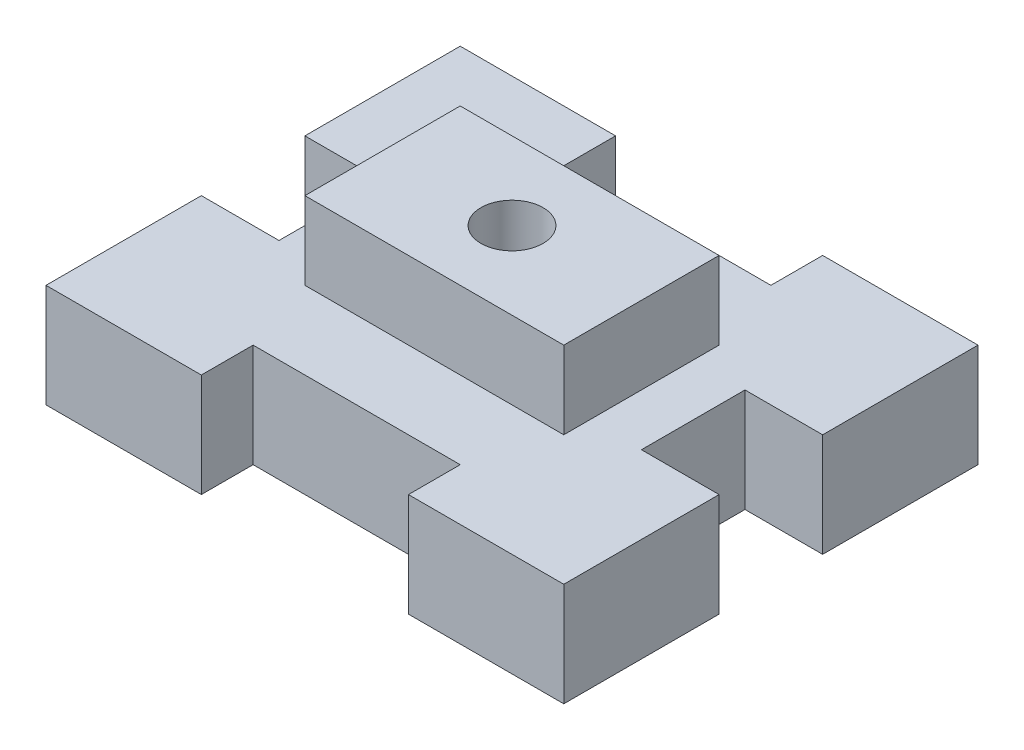
ISO-10303-21;
HEADER;
FILE_DESCRIPTION(('STEP AP214'),'2;1');
FILE_NAME('part.step','',(''),(''),'','','');
FILE_SCHEMA(('AUTOMOTIVE_DESIGN { 1 0 10303 214 1 1 1 1 }'));
ENDSEC;
DATA;
#1=APPLICATION_CONTEXT('core data for automotive mechanical design processes');
#2=APPLICATION_PROTOCOL_DEFINITION('international standard','automotive_design',2000,#1);
#3=PRODUCT_CONTEXT('',#1,'mechanical');
#4=PRODUCT('Part','Part','',(#3));
#5=PRODUCT_RELATED_PRODUCT_CATEGORY('part','',(#4));
#6=PRODUCT_DEFINITION_FORMATION('','',#4);
#7=PRODUCT_DEFINITION_CONTEXT('part definition',#1,'design');
#8=PRODUCT_DEFINITION('design','',#6,#7);
#9=PRODUCT_DEFINITION_SHAPE('','',#8);
#10=(LENGTH_UNIT() NAMED_UNIT(*) SI_UNIT(.MILLI.,.METRE.));
#11=(NAMED_UNIT(*) PLANE_ANGLE_UNIT() SI_UNIT($,.RADIAN.));
#12=(NAMED_UNIT(*) SI_UNIT($,.STERADIAN.) SOLID_ANGLE_UNIT());
#13=UNCERTAINTY_MEASURE_WITH_UNIT(LENGTH_MEASURE(1.E-05),#10,'distance_accuracy_value','');
#14=(GEOMETRIC_REPRESENTATION_CONTEXT(3) GLOBAL_UNCERTAINTY_ASSIGNED_CONTEXT((#13)) GLOBAL_UNIT_ASSIGNED_CONTEXT((#10,
#11,#12)) REPRESENTATION_CONTEXT('',''));
#15=CARTESIAN_POINT('',(0.,0.,0.));
#16=DIRECTION('',(0.,0.,1.));
#17=DIRECTION('',(1.,0.,0.));
#18=AXIS2_PLACEMENT_3D('',#15,#16,#17);
#19=CARTESIAN_POINT('',(0.,-10.,30.));
#20=DIRECTION('',(-1.,0.,0.));
#21=DIRECTION('',(0.,0.,1.));
#22=AXIS2_PLACEMENT_3D('',#19,#20,#21);
#23=PLANE('',#22);
#24=DIRECTION('',(0.,1.,0.));
#25=VECTOR('',#24,1.);
#26=CARTESIAN_POINT('',(0.,-10.,30.));
#27=LINE('',#26,#25);
#28=CARTESIAN_POINT('',(0.,-10.,30.));
#29=VERTEX_POINT('',#28);
#30=CARTESIAN_POINT('',(0.,10.,30.));
#31=VERTEX_POINT('',#30);
#32=EDGE_CURVE('E464',#29,#31,#27,.T.);
#33=ORIENTED_EDGE('',*,*,#32,.T.);
#34=DIRECTION('',(0.,0.,1.));
#35=VECTOR('',#34,1.);
#36=CARTESIAN_POINT('',(0.,10.,30.));
#37=LINE('',#36,#35);
#38=CARTESIAN_POINT('',(0.,10.,0.));
#39=VERTEX_POINT('',#38);
#40=EDGE_CURVE('E304',#39,#31,#37,.T.);
#41=ORIENTED_EDGE('',*,*,#40,.F.);
#42=DIRECTION('',(0.,1.,0.));
#43=VECTOR('',#42,1.);
#44=CARTESIAN_POINT('',(0.,-10.,0.));
#45=LINE('',#44,#43);
#46=CARTESIAN_POINT('',(0.,-10.,0.));
#47=VERTEX_POINT('',#46);
#48=EDGE_CURVE('E465',#47,#39,#45,.T.);
#49=ORIENTED_EDGE('',*,*,#48,.F.);
#50=DIRECTION('',(0.,0.,1.));
#51=VECTOR('',#50,1.);
#52=CARTESIAN_POINT('',(0.,-10.,30.));
#53=LINE('',#52,#51);
#54=EDGE_CURVE('E384',#47,#29,#53,.T.);
#55=ORIENTED_EDGE('',*,*,#54,.T.);
#56=EDGE_LOOP('',(#33,#41,#49,#55));
#57=FACE_BOUND('',#56,.T.);
#58=ADVANCED_FACE('F39',(#57),#23,.T.);
#59=CARTESIAN_POINT('',(0.,-10.,0.));
#60=DIRECTION('',(0.,0.,-1.));
#61=DIRECTION('',(-1.,0.,0.));
#62=AXIS2_PLACEMENT_3D('',#59,#60,#61);
#63=PLANE('',#62);
#64=ORIENTED_EDGE('',*,*,#48,.T.);
#65=DIRECTION('',(-1.,0.,0.));
#66=VECTOR('',#65,1.);
#67=CARTESIAN_POINT('',(0.,10.,0.));
#68=LINE('',#67,#66);
#69=CARTESIAN_POINT('',(30.,10.,0.));
#70=VERTEX_POINT('',#69);
#71=EDGE_CURVE('E380',#70,#39,#68,.T.);
#72=ORIENTED_EDGE('',*,*,#71,.F.);
#73=DIRECTION('',(0.,1.,0.));
#74=VECTOR('',#73,1.);
#75=CARTESIAN_POINT('',(30.,-10.,0.));
#76=LINE('',#75,#74);
#77=CARTESIAN_POINT('',(30.,-10.,0.));
#78=VERTEX_POINT('',#77);
#79=EDGE_CURVE('E469',#78,#70,#76,.T.);
#80=ORIENTED_EDGE('',*,*,#79,.F.);
#81=DIRECTION('',(-1.,0.,0.));
#82=VECTOR('',#81,1.);
#83=CARTESIAN_POINT('',(0.,-10.,0.));
#84=LINE('',#83,#82);
#85=EDGE_CURVE('E460',#78,#47,#84,.T.);
#86=ORIENTED_EDGE('',*,*,#85,.T.);
#87=EDGE_LOOP('',(#64,#72,#80,#86));
#88=FACE_BOUND('',#87,.T.);
#89=ADVANCED_FACE('F557',(#88),#63,.T.);
#90=CARTESIAN_POINT('',(30.,-10.,0.));
#91=DIRECTION('',(1.,0.,0.));
#92=DIRECTION('',(0.,0.,-1.));
#93=AXIS2_PLACEMENT_3D('',#90,#91,#92);
#94=PLANE('',#93);
#95=ORIENTED_EDGE('',*,*,#79,.T.);
#96=DIRECTION('',(0.,0.,-1.));
#97=VECTOR('',#96,1.);
#98=CARTESIAN_POINT('',(30.,10.,0.));
#99=LINE('',#98,#97);
#100=CARTESIAN_POINT('',(30.,10.,10.));
#101=VERTEX_POINT('',#100);
#102=EDGE_CURVE('E376',#101,#70,#99,.T.);
#103=ORIENTED_EDGE('',*,*,#102,.F.);
#104=DIRECTION('',(0.,1.,0.));
#105=VECTOR('',#104,1.);
#106=CARTESIAN_POINT('',(30.,-10.,10.));
#107=LINE('',#106,#105);
#108=CARTESIAN_POINT('',(30.,-10.,10.));
#109=VERTEX_POINT('',#108);
#110=EDGE_CURVE('E472',#109,#101,#107,.T.);
#111=ORIENTED_EDGE('',*,*,#110,.F.);
#112=DIRECTION('',(0.,0.,-1.));
#113=VECTOR('',#112,1.);
#114=CARTESIAN_POINT('',(30.,-10.,0.));
#115=LINE('',#114,#113);
#116=EDGE_CURVE('E456',#109,#78,#115,.T.);
#117=ORIENTED_EDGE('',*,*,#116,.T.);
#118=EDGE_LOOP('',(#95,#103,#111,#117));
#119=FACE_BOUND('',#118,.T.);
#120=ADVANCED_FACE('F562',(#119),#94,.T.);
#121=CARTESIAN_POINT('',(30.,-10.,10.));
#122=DIRECTION('',(0.,0.,-1.));
#123=DIRECTION('',(-1.,0.,0.));
#124=AXIS2_PLACEMENT_3D('',#121,#122,#123);
#125=PLANE('',#124);
#126=ORIENTED_EDGE('',*,*,#110,.T.);
#127=DIRECTION('',(-1.,0.,0.));
#128=VECTOR('',#127,1.);
#129=CARTESIAN_POINT('',(30.,10.,10.));
#130=LINE('',#129,#128);
#131=CARTESIAN_POINT('',(70.,10.,10.));
#132=VERTEX_POINT('',#131);
#133=EDGE_CURVE('E372',#132,#101,#130,.T.);
#134=ORIENTED_EDGE('',*,*,#133,.F.);
#135=DIRECTION('',(0.,1.,0.));
#136=VECTOR('',#135,1.);
#137=CARTESIAN_POINT('',(70.,-10.,10.));
#138=LINE('',#137,#136);
#139=CARTESIAN_POINT('',(70.,-10.,10.));
#140=VERTEX_POINT('',#139);
#141=EDGE_CURVE('E475',#140,#132,#138,.T.);
#142=ORIENTED_EDGE('',*,*,#141,.F.);
#143=DIRECTION('',(-1.,0.,0.));
#144=VECTOR('',#143,1.);
#145=CARTESIAN_POINT('',(30.,-10.,10.));
#146=LINE('',#145,#144);
#147=EDGE_CURVE('E452',#140,#109,#146,.T.);
#148=ORIENTED_EDGE('',*,*,#147,.T.);
#149=EDGE_LOOP('',(#126,#134,#142,#148));
#150=FACE_BOUND('',#149,.T.);
#151=ADVANCED_FACE('F639',(#150),#125,.T.);
#152=CARTESIAN_POINT('',(70.,-10.,10.));
#153=DIRECTION('',(-1.,0.,0.));
#154=DIRECTION('',(0.,0.,1.));
#155=AXIS2_PLACEMENT_3D('',#152,#153,#154);
#156=PLANE('',#155);
#157=ORIENTED_EDGE('',*,*,#141,.T.);
#158=DIRECTION('',(0.,0.,1.));
#159=VECTOR('',#158,1.);
#160=CARTESIAN_POINT('',(70.,10.,10.));
#161=LINE('',#160,#159);
#162=CARTESIAN_POINT('',(70.,10.,0.));
#163=VERTEX_POINT('',#162);
#164=EDGE_CURVE('E368',#163,#132,#161,.T.);
#165=ORIENTED_EDGE('',*,*,#164,.F.);
#166=DIRECTION('',(0.,1.,0.));
#167=VECTOR('',#166,1.);
#168=CARTESIAN_POINT('',(70.,-10.,0.));
#169=LINE('',#168,#167);
#170=CARTESIAN_POINT('',(70.,-10.,0.));
#171=VERTEX_POINT('',#170);
#172=EDGE_CURVE('E478',#171,#163,#169,.T.);
#173=ORIENTED_EDGE('',*,*,#172,.F.);
#174=DIRECTION('',(0.,0.,1.));
#175=VECTOR('',#174,1.);
#176=CARTESIAN_POINT('',(70.,-10.,10.));
#177=LINE('',#176,#175);
#178=EDGE_CURVE('E448',#171,#140,#177,.T.);
#179=ORIENTED_EDGE('',*,*,#178,.T.);
#180=EDGE_LOOP('',(#157,#165,#173,#179));
#181=FACE_BOUND('',#180,.T.);
#182=ADVANCED_FACE('F636',(#181),#156,.T.);
#183=CARTESIAN_POINT('',(70.,-10.,0.));
#184=DIRECTION('',(0.,0.,-1.));
#185=DIRECTION('',(-1.,0.,0.));
#186=AXIS2_PLACEMENT_3D('',#183,#184,#185);
#187=PLANE('',#186);
#188=ORIENTED_EDGE('',*,*,#172,.T.);
#189=DIRECTION('',(-1.,0.,0.));
#190=VECTOR('',#189,1.);
#191=CARTESIAN_POINT('',(70.,10.,0.));
#192=LINE('',#191,#190);
#193=CARTESIAN_POINT('',(100.,10.,0.));
#194=VERTEX_POINT('',#193);
#195=EDGE_CURVE('E364',#194,#163,#192,.T.);
#196=ORIENTED_EDGE('',*,*,#195,.F.);
#197=DIRECTION('',(0.,1.,0.));
#198=VECTOR('',#197,1.);
#199=CARTESIAN_POINT('',(100.,-10.,0.));
#200=LINE('',#199,#198);
#201=CARTESIAN_POINT('',(100.,-10.,0.));
#202=VERTEX_POINT('',#201);
#203=EDGE_CURVE('E481',#202,#194,#200,.T.);
#204=ORIENTED_EDGE('',*,*,#203,.F.);
#205=DIRECTION('',(-1.,0.,0.));
#206=VECTOR('',#205,1.);
#207=CARTESIAN_POINT('',(70.,-10.,0.));
#208=LINE('',#207,#206);
#209=EDGE_CURVE('E444',#202,#171,#208,.T.);
#210=ORIENTED_EDGE('',*,*,#209,.T.);
#211=EDGE_LOOP('',(#188,#196,#204,#210));
#212=FACE_BOUND('',#211,.T.);
#213=ADVANCED_FACE('F634',(#212),#187,.T.);
#214=CARTESIAN_POINT('',(100.,-10.,0.));
#215=DIRECTION('',(1.,0.,0.));
#216=DIRECTION('',(0.,0.,-1.));
#217=AXIS2_PLACEMENT_3D('',#214,#215,#216);
#218=PLANE('',#217);
#219=ORIENTED_EDGE('',*,*,#203,.T.);
#220=DIRECTION('',(0.,0.,-1.));
#221=VECTOR('',#220,1.);
#222=CARTESIAN_POINT('',(100.,10.,0.));
#223=LINE('',#222,#221);
#224=CARTESIAN_POINT('',(100.,10.,30.));
#225=VERTEX_POINT('',#224);
#226=EDGE_CURVE('E360',#225,#194,#223,.T.);
#227=ORIENTED_EDGE('',*,*,#226,.F.);
#228=DIRECTION('',(0.,1.,0.));
#229=VECTOR('',#228,1.);
#230=CARTESIAN_POINT('',(100.,-10.,30.));
#231=LINE('',#230,#229);
#232=CARTESIAN_POINT('',(100.,-10.,30.));
#233=VERTEX_POINT('',#232);
#234=EDGE_CURVE('E484',#233,#225,#231,.T.);
#235=ORIENTED_EDGE('',*,*,#234,.F.);
#236=DIRECTION('',(0.,0.,-1.));
#237=VECTOR('',#236,1.);
#238=CARTESIAN_POINT('',(100.,-10.,0.));
#239=LINE('',#238,#237);
#240=EDGE_CURVE('E440',#233,#202,#239,.T.);
#241=ORIENTED_EDGE('',*,*,#240,.T.);
#242=EDGE_LOOP('',(#219,#227,#235,#241));
#243=FACE_BOUND('',#242,.T.);
#244=ADVANCED_FACE('F629',(#243),#218,.T.);
#245=CARTESIAN_POINT('',(100.,-10.,30.));
#246=DIRECTION('',(0.,0.,1.));
#247=DIRECTION('',(1.,0.,0.));
#248=AXIS2_PLACEMENT_3D('',#245,#246,#247);
#249=PLANE('',#248);
#250=ORIENTED_EDGE('',*,*,#234,.T.);
#251=DIRECTION('',(1.,0.,0.));
#252=VECTOR('',#251,1.);
#253=CARTESIAN_POINT('',(100.,10.,30.));
#254=LINE('',#253,#252);
#255=CARTESIAN_POINT('',(85.,10.,30.));
#256=VERTEX_POINT('',#255);
#257=EDGE_CURVE('E356',#256,#225,#254,.T.);
#258=ORIENTED_EDGE('',*,*,#257,.F.);
#259=DIRECTION('',(0.,1.,0.));
#260=VECTOR('',#259,1.);
#261=CARTESIAN_POINT('',(85.,-10.,30.));
#262=LINE('',#261,#260);
#263=CARTESIAN_POINT('',(85.,-10.,30.));
#264=VERTEX_POINT('',#263);
#265=EDGE_CURVE('E487',#264,#256,#262,.T.);
#266=ORIENTED_EDGE('',*,*,#265,.F.);
#267=DIRECTION('',(1.,0.,0.));
#268=VECTOR('',#267,1.);
#269=CARTESIAN_POINT('',(100.,-10.,30.));
#270=LINE('',#269,#268);
#271=EDGE_CURVE('E436',#264,#233,#270,.T.);
#272=ORIENTED_EDGE('',*,*,#271,.T.);
#273=EDGE_LOOP('',(#250,#258,#266,#272));
#274=FACE_BOUND('',#273,.T.);
#275=ADVANCED_FACE('F624',(#274),#249,.T.);
#276=CARTESIAN_POINT('',(85.,-10.,30.));
#277=DIRECTION('',(1.,0.,0.));
#278=DIRECTION('',(0.,0.,-1.));
#279=AXIS2_PLACEMENT_3D('',#276,#277,#278);
#280=PLANE('',#279);
#281=ORIENTED_EDGE('',*,*,#265,.T.);
#282=DIRECTION('',(0.,0.,-1.));
#283=VECTOR('',#282,1.);
#284=CARTESIAN_POINT('',(85.,10.,30.));
#285=LINE('',#284,#283);
#286=CARTESIAN_POINT('',(85.,10.,50.));
#287=VERTEX_POINT('',#286);
#288=EDGE_CURVE('E352',#287,#256,#285,.T.);
#289=ORIENTED_EDGE('',*,*,#288,.F.);
#290=DIRECTION('',(0.,1.,0.));
#291=VECTOR('',#290,1.);
#292=CARTESIAN_POINT('',(85.,-10.,50.));
#293=LINE('',#292,#291);
#294=CARTESIAN_POINT('',(85.,-10.,50.));
#295=VERTEX_POINT('',#294);
#296=EDGE_CURVE('E490',#295,#287,#293,.T.);
#297=ORIENTED_EDGE('',*,*,#296,.F.);
#298=DIRECTION('',(0.,0.,-1.));
#299=VECTOR('',#298,1.);
#300=CARTESIAN_POINT('',(85.,-10.,30.));
#301=LINE('',#300,#299);
#302=EDGE_CURVE('E432',#295,#264,#301,.T.);
#303=ORIENTED_EDGE('',*,*,#302,.T.);
#304=EDGE_LOOP('',(#281,#289,#297,#303));
#305=FACE_BOUND('',#304,.T.);
#306=ADVANCED_FACE('F622',(#305),#280,.T.);
#307=CARTESIAN_POINT('',(85.,-10.,50.));
#308=DIRECTION('',(0.,0.,-1.));
#309=DIRECTION('',(-1.,0.,0.));
#310=AXIS2_PLACEMENT_3D('',#307,#308,#309);
#311=PLANE('',#310);
#312=ORIENTED_EDGE('',*,*,#296,.T.);
#313=DIRECTION('',(-1.,0.,0.));
#314=VECTOR('',#313,1.);
#315=CARTESIAN_POINT('',(85.,10.,50.));
#316=LINE('',#315,#314);
#317=CARTESIAN_POINT('',(100.,10.,50.));
#318=VERTEX_POINT('',#317);
#319=EDGE_CURVE('E348',#318,#287,#316,.T.);
#320=ORIENTED_EDGE('',*,*,#319,.F.);
#321=DIRECTION('',(0.,1.,0.));
#322=VECTOR('',#321,1.);
#323=CARTESIAN_POINT('',(100.,-10.,50.));
#324=LINE('',#323,#322);
#325=CARTESIAN_POINT('',(100.,-10.,50.));
#326=VERTEX_POINT('',#325);
#327=EDGE_CURVE('E493',#326,#318,#324,.T.);
#328=ORIENTED_EDGE('',*,*,#327,.F.);
#329=DIRECTION('',(-1.,0.,0.));
#330=VECTOR('',#329,1.);
#331=CARTESIAN_POINT('',(85.,-10.,50.));
#332=LINE('',#331,#330);
#333=EDGE_CURVE('E428',#326,#295,#332,.T.);
#334=ORIENTED_EDGE('',*,*,#333,.T.);
#335=EDGE_LOOP('',(#312,#320,#328,#334));
#336=FACE_BOUND('',#335,.T.);
#337=ADVANCED_FACE('F617',(#336),#311,.T.);
#338=CARTESIAN_POINT('',(100.,-10.,50.));
#339=DIRECTION('',(1.,0.,0.));
#340=DIRECTION('',(0.,0.,-1.));
#341=AXIS2_PLACEMENT_3D('',#338,#339,#340);
#342=PLANE('',#341);
#343=ORIENTED_EDGE('',*,*,#327,.T.);
#344=DIRECTION('',(0.,0.,-1.));
#345=VECTOR('',#344,1.);
#346=CARTESIAN_POINT('',(100.,10.,50.));
#347=LINE('',#346,#345);
#348=CARTESIAN_POINT('',(100.,10.,80.));
#349=VERTEX_POINT('',#348);
#350=EDGE_CURVE('E344',#349,#318,#347,.T.);
#351=ORIENTED_EDGE('',*,*,#350,.F.);
#352=DIRECTION('',(0.,1.,0.));
#353=VECTOR('',#352,1.);
#354=CARTESIAN_POINT('',(100.,-10.,80.));
#355=LINE('',#354,#353);
#356=CARTESIAN_POINT('',(100.,-10.,80.));
#357=VERTEX_POINT('',#356);
#358=EDGE_CURVE('E496',#357,#349,#355,.T.);
#359=ORIENTED_EDGE('',*,*,#358,.F.);
#360=DIRECTION('',(0.,0.,-1.));
#361=VECTOR('',#360,1.);
#362=CARTESIAN_POINT('',(100.,-10.,50.));
#363=LINE('',#362,#361);
#364=EDGE_CURVE('E424',#357,#326,#363,.T.);
#365=ORIENTED_EDGE('',*,*,#364,.T.);
#366=EDGE_LOOP('',(#343,#351,#359,#365));
#367=FACE_BOUND('',#366,.T.);
#368=ADVANCED_FACE('F612',(#367),#342,.T.);
#369=CARTESIAN_POINT('',(100.,-10.,80.));
#370=DIRECTION('',(0.,0.,1.));
#371=DIRECTION('',(1.,0.,0.));
#372=AXIS2_PLACEMENT_3D('',#369,#370,#371);
#373=PLANE('',#372);
#374=ORIENTED_EDGE('',*,*,#358,.T.);
#375=DIRECTION('',(1.,0.,0.));
#376=VECTOR('',#375,1.);
#377=CARTESIAN_POINT('',(100.,10.,80.));
#378=LINE('',#377,#376);
#379=CARTESIAN_POINT('',(70.,10.,80.));
#380=VERTEX_POINT('',#379);
#381=EDGE_CURVE('E340',#380,#349,#378,.T.);
#382=ORIENTED_EDGE('',*,*,#381,.F.);
#383=DIRECTION('',(0.,1.,0.));
#384=VECTOR('',#383,1.);
#385=CARTESIAN_POINT('',(70.,-10.,80.));
#386=LINE('',#385,#384);
#387=CARTESIAN_POINT('',(70.,-10.,80.));
#388=VERTEX_POINT('',#387);
#389=EDGE_CURVE('E499',#388,#380,#386,.T.);
#390=ORIENTED_EDGE('',*,*,#389,.F.);
#391=DIRECTION('',(1.,0.,0.));
#392=VECTOR('',#391,1.);
#393=CARTESIAN_POINT('',(100.,-10.,80.));
#394=LINE('',#393,#392);
#395=EDGE_CURVE('E420',#388,#357,#394,.T.);
#396=ORIENTED_EDGE('',*,*,#395,.T.);
#397=EDGE_LOOP('',(#374,#382,#390,#396));
#398=FACE_BOUND('',#397,.T.);
#399=ADVANCED_FACE('F610',(#398),#373,.T.);
#400=CARTESIAN_POINT('',(70.,-10.,80.));
#401=DIRECTION('',(-1.,0.,0.));
#402=DIRECTION('',(0.,0.,1.));
#403=AXIS2_PLACEMENT_3D('',#400,#401,#402);
#404=PLANE('',#403);
#405=ORIENTED_EDGE('',*,*,#389,.T.);
#406=DIRECTION('',(0.,0.,1.));
#407=VECTOR('',#406,1.);
#408=CARTESIAN_POINT('',(70.,10.,80.));
#409=LINE('',#408,#407);
#410=CARTESIAN_POINT('',(70.,10.,70.));
#411=VERTEX_POINT('',#410);
#412=EDGE_CURVE('E336',#411,#380,#409,.T.);
#413=ORIENTED_EDGE('',*,*,#412,.F.);
#414=DIRECTION('',(0.,1.,0.));
#415=VECTOR('',#414,1.);
#416=CARTESIAN_POINT('',(70.,-10.,70.));
#417=LINE('',#416,#415);
#418=CARTESIAN_POINT('',(70.,-10.,70.));
#419=VERTEX_POINT('',#418);
#420=EDGE_CURVE('E502',#419,#411,#417,.T.);
#421=ORIENTED_EDGE('',*,*,#420,.F.);
#422=DIRECTION('',(0.,0.,1.));
#423=VECTOR('',#422,1.);
#424=CARTESIAN_POINT('',(70.,-10.,80.));
#425=LINE('',#424,#423);
#426=EDGE_CURVE('E416',#419,#388,#425,.T.);
#427=ORIENTED_EDGE('',*,*,#426,.T.);
#428=EDGE_LOOP('',(#405,#413,#421,#427));
#429=FACE_BOUND('',#428,.T.);
#430=ADVANCED_FACE('F605',(#429),#404,.T.);
#431=CARTESIAN_POINT('',(70.,-10.,70.));
#432=DIRECTION('',(0.,0.,1.));
#433=DIRECTION('',(1.,0.,0.));
#434=AXIS2_PLACEMENT_3D('',#431,#432,#433);
#435=PLANE('',#434);
#436=ORIENTED_EDGE('',*,*,#420,.T.);
#437=DIRECTION('',(1.,0.,0.));
#438=VECTOR('',#437,1.);
#439=CARTESIAN_POINT('',(70.,10.,70.));
#440=LINE('',#439,#438);
#441=CARTESIAN_POINT('',(30.,10.,70.));
#442=VERTEX_POINT('',#441);
#443=EDGE_CURVE('E332',#442,#411,#440,.T.);
#444=ORIENTED_EDGE('',*,*,#443,.F.);
#445=DIRECTION('',(0.,1.,0.));
#446=VECTOR('',#445,1.);
#447=CARTESIAN_POINT('',(30.,-10.,70.));
#448=LINE('',#447,#446);
#449=CARTESIAN_POINT('',(30.,-10.,70.));
#450=VERTEX_POINT('',#449);
#451=EDGE_CURVE('E505',#450,#442,#448,.T.);
#452=ORIENTED_EDGE('',*,*,#451,.F.);
#453=DIRECTION('',(1.,0.,0.));
#454=VECTOR('',#453,1.);
#455=CARTESIAN_POINT('',(70.,-10.,70.));
#456=LINE('',#455,#454);
#457=EDGE_CURVE('E412',#450,#419,#456,.T.);
#458=ORIENTED_EDGE('',*,*,#457,.T.);
#459=EDGE_LOOP('',(#436,#444,#452,#458));
#460=FACE_BOUND('',#459,.T.);
#461=ADVANCED_FACE('F600',(#460),#435,.T.);
#462=CARTESIAN_POINT('',(30.,-10.,70.));
#463=DIRECTION('',(1.,0.,0.));
#464=DIRECTION('',(0.,0.,-1.));
#465=AXIS2_PLACEMENT_3D('',#462,#463,#464);
#466=PLANE('',#465);
#467=ORIENTED_EDGE('',*,*,#451,.T.);
#468=DIRECTION('',(0.,0.,-1.));
#469=VECTOR('',#468,1.);
#470=CARTESIAN_POINT('',(30.,10.,70.));
#471=LINE('',#470,#469);
#472=CARTESIAN_POINT('',(30.,10.,80.));
#473=VERTEX_POINT('',#472);
#474=EDGE_CURVE('E328',#473,#442,#471,.T.);
#475=ORIENTED_EDGE('',*,*,#474,.F.);
#476=DIRECTION('',(0.,1.,0.));
#477=VECTOR('',#476,1.);
#478=CARTESIAN_POINT('',(30.,-10.,80.));
#479=LINE('',#478,#477);
#480=CARTESIAN_POINT('',(30.,-10.,80.));
#481=VERTEX_POINT('',#480);
#482=EDGE_CURVE('E508',#481,#473,#479,.T.);
#483=ORIENTED_EDGE('',*,*,#482,.F.);
#484=DIRECTION('',(0.,0.,-1.));
#485=VECTOR('',#484,1.);
#486=CARTESIAN_POINT('',(30.,-10.,70.));
#487=LINE('',#486,#485);
#488=EDGE_CURVE('E408',#481,#450,#487,.T.);
#489=ORIENTED_EDGE('',*,*,#488,.T.);
#490=EDGE_LOOP('',(#467,#475,#483,#489));
#491=FACE_BOUND('',#490,.T.);
#492=ADVANCED_FACE('F598',(#491),#466,.T.);
#493=CARTESIAN_POINT('',(30.,-10.,80.));
#494=DIRECTION('',(0.,0.,1.));
#495=DIRECTION('',(1.,0.,0.));
#496=AXIS2_PLACEMENT_3D('',#493,#494,#495);
#497=PLANE('',#496);
#498=ORIENTED_EDGE('',*,*,#482,.T.);
#499=DIRECTION('',(1.,0.,0.));
#500=VECTOR('',#499,1.);
#501=CARTESIAN_POINT('',(30.,10.,80.));
#502=LINE('',#501,#500);
#503=CARTESIAN_POINT('',(0.,10.,80.));
#504=VERTEX_POINT('',#503);
#505=EDGE_CURVE('E324',#504,#473,#502,.T.);
#506=ORIENTED_EDGE('',*,*,#505,.F.);
#507=DIRECTION('',(0.,1.,0.));
#508=VECTOR('',#507,1.);
#509=CARTESIAN_POINT('',(0.,-10.,80.));
#510=LINE('',#509,#508);
#511=CARTESIAN_POINT('',(0.,-10.,80.));
#512=VERTEX_POINT('',#511);
#513=EDGE_CURVE('E511',#512,#504,#510,.T.);
#514=ORIENTED_EDGE('',*,*,#513,.F.);
#515=DIRECTION('',(1.,0.,0.));
#516=VECTOR('',#515,1.);
#517=CARTESIAN_POINT('',(30.,-10.,80.));
#518=LINE('',#517,#516);
#519=EDGE_CURVE('E404',#512,#481,#518,.T.);
#520=ORIENTED_EDGE('',*,*,#519,.T.);
#521=EDGE_LOOP('',(#498,#506,#514,#520));
#522=FACE_BOUND('',#521,.T.);
#523=ADVANCED_FACE('F593',(#522),#497,.T.);
#524=CARTESIAN_POINT('',(0.,-10.,80.));
#525=DIRECTION('',(-1.,0.,0.));
#526=DIRECTION('',(0.,0.,1.));
#527=AXIS2_PLACEMENT_3D('',#524,#525,#526);
#528=PLANE('',#527);
#529=ORIENTED_EDGE('',*,*,#513,.T.);
#530=DIRECTION('',(0.,0.,1.));
#531=VECTOR('',#530,1.);
#532=CARTESIAN_POINT('',(0.,10.,80.));
#533=LINE('',#532,#531);
#534=CARTESIAN_POINT('',(0.,10.,50.));
#535=VERTEX_POINT('',#534);
#536=EDGE_CURVE('E320',#535,#504,#533,.T.);
#537=ORIENTED_EDGE('',*,*,#536,.F.);
#538=DIRECTION('',(0.,1.,0.));
#539=VECTOR('',#538,1.);
#540=CARTESIAN_POINT('',(0.,-10.,50.));
#541=LINE('',#540,#539);
#542=CARTESIAN_POINT('',(0.,-10.,50.));
#543=VERTEX_POINT('',#542);
#544=EDGE_CURVE('E514',#543,#535,#541,.T.);
#545=ORIENTED_EDGE('',*,*,#544,.F.);
#546=DIRECTION('',(0.,0.,1.));
#547=VECTOR('',#546,1.);
#548=CARTESIAN_POINT('',(0.,-10.,80.));
#549=LINE('',#548,#547);
#550=EDGE_CURVE('E400',#543,#512,#549,.T.);
#551=ORIENTED_EDGE('',*,*,#550,.T.);
#552=EDGE_LOOP('',(#529,#537,#545,#551));
#553=FACE_BOUND('',#552,.T.);
#554=ADVANCED_FACE('F588',(#553),#528,.T.);
#555=CARTESIAN_POINT('',(0.,-10.,50.));
#556=DIRECTION('',(0.,0.,-1.));
#557=DIRECTION('',(-1.,0.,0.));
#558=AXIS2_PLACEMENT_3D('',#555,#556,#557);
#559=PLANE('',#558);
#560=ORIENTED_EDGE('',*,*,#544,.T.);
#561=DIRECTION('',(-1.,0.,0.));
#562=VECTOR('',#561,1.);
#563=CARTESIAN_POINT('',(0.,10.,50.));
#564=LINE('',#563,#562);
#565=CARTESIAN_POINT('',(15.,10.,50.));
#566=VERTEX_POINT('',#565);
#567=EDGE_CURVE('E316',#566,#535,#564,.T.);
#568=ORIENTED_EDGE('',*,*,#567,.F.);
#569=DIRECTION('',(0.,1.,0.));
#570=VECTOR('',#569,1.);
#571=CARTESIAN_POINT('',(15.,-10.,50.));
#572=LINE('',#571,#570);
#573=CARTESIAN_POINT('',(15.,-10.,50.));
#574=VERTEX_POINT('',#573);
#575=EDGE_CURVE('E517',#574,#566,#572,.T.);
#576=ORIENTED_EDGE('',*,*,#575,.F.);
#577=DIRECTION('',(-1.,0.,0.));
#578=VECTOR('',#577,1.);
#579=CARTESIAN_POINT('',(0.,-10.,50.));
#580=LINE('',#579,#578);
#581=EDGE_CURVE('E396',#574,#543,#580,.T.);
#582=ORIENTED_EDGE('',*,*,#581,.T.);
#583=EDGE_LOOP('',(#560,#568,#576,#582));
#584=FACE_BOUND('',#583,.T.);
#585=ADVANCED_FACE('F586',(#584),#559,.T.);
#586=CARTESIAN_POINT('',(15.,-10.,50.));
#587=DIRECTION('',(-1.,0.,0.));
#588=DIRECTION('',(0.,0.,1.));
#589=AXIS2_PLACEMENT_3D('',#586,#587,#588);
#590=PLANE('',#589);
#591=ORIENTED_EDGE('',*,*,#575,.T.);
#592=DIRECTION('',(0.,0.,1.));
#593=VECTOR('',#592,1.);
#594=CARTESIAN_POINT('',(15.,10.,50.));
#595=LINE('',#594,#593);
#596=CARTESIAN_POINT('',(15.,10.,30.));
#597=VERTEX_POINT('',#596);
#598=EDGE_CURVE('E312',#597,#566,#595,.T.);
#599=ORIENTED_EDGE('',*,*,#598,.F.);
#600=DIRECTION('',(0.,1.,0.));
#601=VECTOR('',#600,1.);
#602=CARTESIAN_POINT('',(15.,-10.,30.));
#603=LINE('',#602,#601);
#604=CARTESIAN_POINT('',(15.,-10.,30.));
#605=VERTEX_POINT('',#604);
#606=EDGE_CURVE('E520',#605,#597,#603,.T.);
#607=ORIENTED_EDGE('',*,*,#606,.F.);
#608=DIRECTION('',(0.,0.,1.));
#609=VECTOR('',#608,1.);
#610=CARTESIAN_POINT('',(15.,-10.,50.));
#611=LINE('',#610,#609);
#612=EDGE_CURVE('E392',#605,#574,#611,.T.);
#613=ORIENTED_EDGE('',*,*,#612,.T.);
#614=EDGE_LOOP('',(#591,#599,#607,#613));
#615=FACE_BOUND('',#614,.T.);
#616=ADVANCED_FACE('F582',(#615),#590,.T.);
#617=CARTESIAN_POINT('',(15.,-10.,30.));
#618=DIRECTION('',(0.,0.,1.));
#619=DIRECTION('',(1.,0.,0.));
#620=AXIS2_PLACEMENT_3D('',#617,#618,#619);
#621=PLANE('',#620);
#622=ORIENTED_EDGE('',*,*,#606,.T.);
#623=DIRECTION('',(1.,0.,0.));
#624=VECTOR('',#623,1.);
#625=CARTESIAN_POINT('',(15.,10.,30.));
#626=LINE('',#625,#624);
#627=EDGE_CURVE('E308',#31,#597,#626,.T.);
#628=ORIENTED_EDGE('',*,*,#627,.F.);
#629=ORIENTED_EDGE('',*,*,#32,.F.);
#630=DIRECTION('',(1.,0.,0.));
#631=VECTOR('',#630,1.);
#632=CARTESIAN_POINT('',(15.,-10.,30.));
#633=LINE('',#632,#631);
#634=EDGE_CURVE('E388',#29,#605,#633,.T.);
#635=ORIENTED_EDGE('',*,*,#634,.T.);
#636=EDGE_LOOP('',(#622,#628,#629,#635));
#637=FACE_BOUND('',#636,.T.);
#638=ADVANCED_FACE('F570',(#637),#621,.T.);
#639=CARTESIAN_POINT('',(0.,-10.,0.));
#640=DIRECTION('',(0.,-1.,0.));
#641=DIRECTION('',(0.,0.,-1.));
#642=AXIS2_PLACEMENT_3D('',#639,#640,#641);
#643=PLANE('',#642);
#644=DIRECTION('',(1.,0.,0.));
#645=VECTOR('',#644,1.);
#646=CARTESIAN_POINT('',(0.,-10.,25.));
#647=LINE('',#646,#645);
#648=CARTESIAN_POINT('',(25.,-10.,25.));
#649=VERTEX_POINT('',#648);
#650=CARTESIAN_POINT('',(75.,-10.,25.));
#651=VERTEX_POINT('',#650);
#652=EDGE_CURVE('E301',#649,#651,#647,.T.);
#653=ORIENTED_EDGE('',*,*,#652,.F.);
#654=DIRECTION('',(0.,0.,-1.));
#655=VECTOR('',#654,1.);
#656=CARTESIAN_POINT('',(25.,-10.,0.));
#657=LINE('',#656,#655);
#658=CARTESIAN_POINT('',(25.,-10.,55.));
#659=VERTEX_POINT('',#658);
#660=EDGE_CURVE('E281',#659,#649,#657,.T.);
#661=ORIENTED_EDGE('',*,*,#660,.F.);
#662=DIRECTION('',(-1.,0.,0.));
#663=VECTOR('',#662,1.);
#664=CARTESIAN_POINT('',(0.,-10.,55.));
#665=LINE('',#664,#663);
#666=CARTESIAN_POINT('',(75.,-10.,55.));
#667=VERTEX_POINT('',#666);
#668=EDGE_CURVE('E59',#667,#659,#665,.T.);
#669=ORIENTED_EDGE('',*,*,#668,.F.);
#670=DIRECTION('',(0.,0.,1.));
#671=VECTOR('',#670,1.);
#672=CARTESIAN_POINT('',(75.,-10.,0.));
#673=LINE('',#672,#671);
#674=EDGE_CURVE('E54',#651,#667,#673,.T.);
#675=ORIENTED_EDGE('',*,*,#674,.F.);
#676=EDGE_LOOP('',(#653,#661,#669,#675));
#677=FACE_BOUND('',#676,.T.);
#678=ORIENTED_EDGE('',*,*,#54,.F.);
#679=ORIENTED_EDGE('',*,*,#85,.F.);
#680=ORIENTED_EDGE('',*,*,#116,.F.);
#681=ORIENTED_EDGE('',*,*,#147,.F.);
#682=ORIENTED_EDGE('',*,*,#178,.F.);
#683=ORIENTED_EDGE('',*,*,#209,.F.);
#684=ORIENTED_EDGE('',*,*,#240,.F.);
#685=ORIENTED_EDGE('',*,*,#271,.F.);
#686=ORIENTED_EDGE('',*,*,#302,.F.);
#687=ORIENTED_EDGE('',*,*,#333,.F.);
#688=ORIENTED_EDGE('',*,*,#364,.F.);
#689=ORIENTED_EDGE('',*,*,#395,.F.);
#690=ORIENTED_EDGE('',*,*,#426,.F.);
#691=ORIENTED_EDGE('',*,*,#457,.F.);
#692=ORIENTED_EDGE('',*,*,#488,.F.);
#693=ORIENTED_EDGE('',*,*,#519,.F.);
#694=ORIENTED_EDGE('',*,*,#550,.F.);
#695=ORIENTED_EDGE('',*,*,#581,.F.);
#696=ORIENTED_EDGE('',*,*,#612,.F.);
#697=ORIENTED_EDGE('',*,*,#634,.F.);
#698=EDGE_LOOP('',(#678,#679,#680,#681,#682,#683,#684,#685,#686,#687,#688,#689,#690,#691,#692,
#693,#694,#695,#696,#697));
#699=FACE_BOUND('',#698,.T.);
#700=ADVANCED_FACE('F576',(#677,#699),#643,.T.);
#701=CARTESIAN_POINT('',(0.,10.,0.));
#702=DIRECTION('',(0.,-1.,0.));
#703=DIRECTION('',(0.,0.,-1.));
#704=AXIS2_PLACEMENT_3D('',#701,#702,#703);
#705=PLANE('',#704);
#706=DIRECTION('',(0.,0.,-1.));
#707=VECTOR('',#706,1.);
#708=CARTESIAN_POINT('',(25.,10.,0.));
#709=LINE('',#708,#707);
#710=CARTESIAN_POINT('',(25.,10.,55.));
#711=VERTEX_POINT('',#710);
#712=CARTESIAN_POINT('',(25.,10.,25.));
#713=VERTEX_POINT('',#712);
#714=EDGE_CURVE('E468',#711,#713,#709,.T.);
#715=ORIENTED_EDGE('',*,*,#714,.T.);
#716=DIRECTION('',(1.,0.,0.));
#717=VECTOR('',#716,1.);
#718=CARTESIAN_POINT('',(0.,10.,25.));
#719=LINE('',#718,#717);
#720=CARTESIAN_POINT('',(75.,10.,25.));
#721=VERTEX_POINT('',#720);
#722=EDGE_CURVE('E11',#713,#721,#719,.T.);
#723=ORIENTED_EDGE('',*,*,#722,.T.);
#724=DIRECTION('',(0.,0.,1.));
#725=VECTOR('',#724,1.);
#726=CARTESIAN_POINT('',(75.,10.,0.));
#727=LINE('',#726,#725);
#728=CARTESIAN_POINT('',(75.,10.,55.));
#729=VERTEX_POINT('',#728);
#730=EDGE_CURVE('E47',#721,#729,#727,.T.);
#731=ORIENTED_EDGE('',*,*,#730,.T.);
#732=DIRECTION('',(-1.,0.,0.));
#733=VECTOR('',#732,1.);
#734=CARTESIAN_POINT('',(0.,10.,55.));
#735=LINE('',#734,#733);
#736=EDGE_CURVE('E527',#729,#711,#735,.T.);
#737=ORIENTED_EDGE('',*,*,#736,.T.);
#738=EDGE_LOOP('',(#715,#723,#731,#737));
#739=FACE_BOUND('',#738,.T.);
#740=ORIENTED_EDGE('',*,*,#40,.T.);
#741=ORIENTED_EDGE('',*,*,#627,.T.);
#742=ORIENTED_EDGE('',*,*,#598,.T.);
#743=ORIENTED_EDGE('',*,*,#567,.T.);
#744=ORIENTED_EDGE('',*,*,#536,.T.);
#745=ORIENTED_EDGE('',*,*,#505,.T.);
#746=ORIENTED_EDGE('',*,*,#474,.T.);
#747=ORIENTED_EDGE('',*,*,#443,.T.);
#748=ORIENTED_EDGE('',*,*,#412,.T.);
#749=ORIENTED_EDGE('',*,*,#381,.T.);
#750=ORIENTED_EDGE('',*,*,#350,.T.);
#751=ORIENTED_EDGE('',*,*,#319,.T.);
#752=ORIENTED_EDGE('',*,*,#288,.T.);
#753=ORIENTED_EDGE('',*,*,#257,.T.);
#754=ORIENTED_EDGE('',*,*,#226,.T.);
#755=ORIENTED_EDGE('',*,*,#195,.T.);
#756=ORIENTED_EDGE('',*,*,#164,.T.);
#757=ORIENTED_EDGE('',*,*,#133,.T.);
#758=ORIENTED_EDGE('',*,*,#102,.T.);
#759=ORIENTED_EDGE('',*,*,#71,.T.);
#760=EDGE_LOOP('',(#740,#741,#742,#743,#744,#745,#746,#747,#748,#749,#750,#751,#752,#753,#754,
#755,#756,#757,#758,#759));
#761=FACE_BOUND('',#760,.T.);
#762=ADVANCED_FACE('F533',(#739,#761),#705,.F.);
#763=CARTESIAN_POINT('',(0.,25.,0.));
#764=DIRECTION('',(0.,1.,0.));
#765=DIRECTION('',(0.,0.,1.));
#766=AXIS2_PLACEMENT_3D('',#763,#764,#765);
#767=PLANE('',#766);
#768=CARTESIAN_POINT('',(50.,25.,40.));
#769=DIRECTION('',(0.,1.,0.));
#770=DIRECTION('',(0.,0.,1.));
#771=AXIS2_PLACEMENT_3D('',#768,#769,#770);
#772=CIRCLE('',#771,5.99999999999999);
#773=CARTESIAN_POINT('',(50.,25.,46.));
#774=VERTEX_POINT('',#773);
#775=EDGE_CURVE('E254',#774,#774,#772,.T.);
#776=ORIENTED_EDGE('',*,*,#775,.F.);
#777=EDGE_LOOP('',(#776));
#778=FACE_BOUND('',#777,.T.);
#779=DIRECTION('',(-1.,0.,0.));
#780=VECTOR('',#779,1.);
#781=CARTESIAN_POINT('',(75.,25.,25.));
#782=LINE('',#781,#780);
#783=CARTESIAN_POINT('',(75.,25.,25.));
#784=VERTEX_POINT('',#783);
#785=CARTESIAN_POINT('',(25.,25.,25.));
#786=VERTEX_POINT('',#785);
#787=EDGE_CURVE('E227',#784,#786,#782,.T.);
#788=ORIENTED_EDGE('',*,*,#787,.T.);
#789=DIRECTION('',(0.,0.,1.));
#790=VECTOR('',#789,1.);
#791=CARTESIAN_POINT('',(25.,25.,25.));
#792=LINE('',#791,#790);
#793=CARTESIAN_POINT('',(25.,25.,55.));
#794=VERTEX_POINT('',#793);
#795=EDGE_CURVE('E235',#786,#794,#792,.T.);
#796=ORIENTED_EDGE('',*,*,#795,.T.);
#797=DIRECTION('',(1.,0.,0.));
#798=VECTOR('',#797,1.);
#799=CARTESIAN_POINT('',(25.,25.,55.));
#800=LINE('',#799,#798);
#801=CARTESIAN_POINT('',(75.,25.,55.));
#802=VERTEX_POINT('',#801);
#803=EDGE_CURVE('E243',#794,#802,#800,.T.);
#804=ORIENTED_EDGE('',*,*,#803,.T.);
#805=DIRECTION('',(0.,0.,-1.));
#806=VECTOR('',#805,1.);
#807=CARTESIAN_POINT('',(75.,25.,55.));
#808=LINE('',#807,#806);
#809=EDGE_CURVE('E248',#802,#784,#808,.T.);
#810=ORIENTED_EDGE('',*,*,#809,.T.);
#811=EDGE_LOOP('',(#788,#796,#804,#810));
#812=FACE_BOUND('',#811,.T.);
#813=ADVANCED_FACE('F246',(#778,#812),#767,.T.);
#814=CARTESIAN_POINT('',(25.,-25.,25.));
#815=DIRECTION('',(-1.,0.,0.));
#816=DIRECTION('',(0.,0.,1.));
#817=AXIS2_PLACEMENT_3D('',#814,#815,#816);
#818=PLANE('',#817);
#819=ORIENTED_EDGE('',*,*,#714,.F.);
#820=DIRECTION('',(0.,1.,0.));
#821=VECTOR('',#820,1.);
#822=CARTESIAN_POINT('',(25.,-25.,55.));
#823=LINE('',#822,#821);
#824=EDGE_CURVE('E238',#711,#794,#823,.T.);
#825=ORIENTED_EDGE('',*,*,#824,.T.);
#826=ORIENTED_EDGE('',*,*,#795,.F.);
#827=DIRECTION('',(0.,1.,0.));
#828=VECTOR('',#827,1.);
#829=CARTESIAN_POINT('',(25.,-25.,25.));
#830=LINE('',#829,#828);
#831=EDGE_CURVE('E222',#713,#786,#830,.T.);
#832=ORIENTED_EDGE('',*,*,#831,.F.);
#833=EDGE_LOOP('',(#819,#825,#826,#832));
#834=FACE_BOUND('',#833,.T.);
#835=ADVANCED_FACE('F236',(#834),#818,.T.);
#836=CARTESIAN_POINT('',(25.,-25.,55.));
#837=DIRECTION('',(0.,0.,1.));
#838=DIRECTION('',(1.,0.,0.));
#839=AXIS2_PLACEMENT_3D('',#836,#837,#838);
#840=PLANE('',#839);
#841=ORIENTED_EDGE('',*,*,#736,.F.);
#842=DIRECTION('',(0.,1.,0.));
#843=VECTOR('',#842,1.);
#844=CARTESIAN_POINT('',(75.,-25.,55.));
#845=LINE('',#844,#843);
#846=EDGE_CURVE('E287',#729,#802,#845,.T.);
#847=ORIENTED_EDGE('',*,*,#846,.T.);
#848=ORIENTED_EDGE('',*,*,#803,.F.);
#849=ORIENTED_EDGE('',*,*,#824,.F.);
#850=EDGE_LOOP('',(#841,#847,#848,#849));
#851=FACE_BOUND('',#850,.T.);
#852=ADVANCED_FACE('F542',(#851),#840,.T.);
#853=CARTESIAN_POINT('',(75.,-25.,55.));
#854=DIRECTION('',(1.,0.,0.));
#855=DIRECTION('',(0.,0.,-1.));
#856=AXIS2_PLACEMENT_3D('',#853,#854,#855);
#857=PLANE('',#856);
#858=ORIENTED_EDGE('',*,*,#730,.F.);
#859=DIRECTION('',(0.,1.,0.));
#860=VECTOR('',#859,1.);
#861=CARTESIAN_POINT('',(75.,-25.,25.));
#862=LINE('',#861,#860);
#863=EDGE_CURVE('E282',#721,#784,#862,.T.);
#864=ORIENTED_EDGE('',*,*,#863,.T.);
#865=ORIENTED_EDGE('',*,*,#809,.F.);
#866=ORIENTED_EDGE('',*,*,#846,.F.);
#867=EDGE_LOOP('',(#858,#864,#865,#866));
#868=FACE_BOUND('',#867,.T.);
#869=ADVANCED_FACE('F537',(#868),#857,.T.);
#870=CARTESIAN_POINT('',(75.,-25.,25.));
#871=DIRECTION('',(0.,0.,-1.));
#872=DIRECTION('',(-1.,0.,0.));
#873=AXIS2_PLACEMENT_3D('',#870,#871,#872);
#874=PLANE('',#873);
#875=ORIENTED_EDGE('',*,*,#722,.F.);
#876=ORIENTED_EDGE('',*,*,#831,.T.);
#877=ORIENTED_EDGE('',*,*,#787,.F.);
#878=ORIENTED_EDGE('',*,*,#863,.F.);
#879=EDGE_LOOP('',(#875,#876,#877,#878));
#880=FACE_BOUND('',#879,.T.);
#881=ADVANCED_FACE('F224',(#880),#874,.T.);
#882=CARTESIAN_POINT('',(25.,-25.,25.));
#883=VERTEX_POINT('',#882);
#884=EDGE_CURVE('E231',#883,#649,#830,.T.);
#885=ORIENTED_EDGE('',*,*,#884,.T.);
#886=ORIENTED_EDGE('',*,*,#652,.T.);
#887=CARTESIAN_POINT('',(75.,-25.,25.));
#888=VERTEX_POINT('',#887);
#889=EDGE_CURVE('E277',#888,#651,#862,.T.);
#890=ORIENTED_EDGE('',*,*,#889,.F.);
#891=DIRECTION('',(-1.,0.,0.));
#892=VECTOR('',#891,1.);
#893=CARTESIAN_POINT('',(75.,-25.,25.));
#894=LINE('',#893,#892);
#895=EDGE_CURVE('E262',#888,#883,#894,.T.);
#896=ORIENTED_EDGE('',*,*,#895,.T.);
#897=EDGE_LOOP('',(#885,#886,#890,#896));
#898=FACE_BOUND('',#897,.T.);
#899=ADVANCED_FACE('F688',(#898),#874,.T.);
#900=ORIENTED_EDGE('',*,*,#889,.T.);
#901=ORIENTED_EDGE('',*,*,#674,.T.);
#902=CARTESIAN_POINT('',(75.,-25.,55.));
#903=VERTEX_POINT('',#902);
#904=EDGE_CURVE('E283',#903,#667,#845,.T.);
#905=ORIENTED_EDGE('',*,*,#904,.F.);
#906=DIRECTION('',(0.,0.,-1.));
#907=VECTOR('',#906,1.);
#908=CARTESIAN_POINT('',(75.,-25.,55.));
#909=LINE('',#908,#907);
#910=EDGE_CURVE('E232',#903,#888,#909,.T.);
#911=ORIENTED_EDGE('',*,*,#910,.T.);
#912=EDGE_LOOP('',(#900,#901,#905,#911));
#913=FACE_BOUND('',#912,.T.);
#914=ADVANCED_FACE('F551',(#913),#857,.T.);
#915=ORIENTED_EDGE('',*,*,#904,.T.);
#916=ORIENTED_EDGE('',*,*,#668,.T.);
#917=CARTESIAN_POINT('',(25.,-25.,55.));
#918=VERTEX_POINT('',#917);
#919=EDGE_CURVE('E288',#918,#659,#823,.T.);
#920=ORIENTED_EDGE('',*,*,#919,.F.);
#921=DIRECTION('',(1.,0.,0.));
#922=VECTOR('',#921,1.);
#923=CARTESIAN_POINT('',(25.,-25.,55.));
#924=LINE('',#923,#922);
#925=EDGE_CURVE('E270',#918,#903,#924,.T.);
#926=ORIENTED_EDGE('',*,*,#925,.T.);
#927=EDGE_LOOP('',(#915,#916,#920,#926));
#928=FACE_BOUND('',#927,.T.);
#929=ADVANCED_FACE('F545',(#928),#840,.T.);
#930=ORIENTED_EDGE('',*,*,#919,.T.);
#931=ORIENTED_EDGE('',*,*,#660,.T.);
#932=ORIENTED_EDGE('',*,*,#884,.F.);
#933=DIRECTION('',(0.,0.,1.));
#934=VECTOR('',#933,1.);
#935=CARTESIAN_POINT('',(25.,-25.,25.));
#936=LINE('',#935,#934);
#937=EDGE_CURVE('E266',#883,#918,#936,.T.);
#938=ORIENTED_EDGE('',*,*,#937,.T.);
#939=EDGE_LOOP('',(#930,#931,#932,#938));
#940=FACE_BOUND('',#939,.T.);
#941=ADVANCED_FACE('F553',(#940),#818,.T.);
#942=CARTESIAN_POINT('',(0.,-25.,0.));
#943=DIRECTION('',(0.,1.,0.));
#944=DIRECTION('',(0.,0.,1.));
#945=AXIS2_PLACEMENT_3D('',#942,#943,#944);
#946=PLANE('',#945);
#947=CARTESIAN_POINT('',(50.,-25.,40.));
#948=DIRECTION('',(0.,1.,0.));
#949=DIRECTION('',(0.,0.,1.));
#950=AXIS2_PLACEMENT_3D('',#947,#948,#949);
#951=CIRCLE('',#950,5.99999999999999);
#952=CARTESIAN_POINT('',(50.,-25.,46.));
#953=VERTEX_POINT('',#952);
#954=EDGE_CURVE('E250',#953,#953,#951,.T.);
#955=ORIENTED_EDGE('',*,*,#954,.T.);
#956=EDGE_LOOP('',(#955));
#957=FACE_BOUND('',#956,.T.);
#958=ORIENTED_EDGE('',*,*,#895,.F.);
#959=ORIENTED_EDGE('',*,*,#910,.F.);
#960=ORIENTED_EDGE('',*,*,#925,.F.);
#961=ORIENTED_EDGE('',*,*,#937,.F.);
#962=EDGE_LOOP('',(#958,#959,#960,#961));
#963=FACE_BOUND('',#962,.T.);
#964=ADVANCED_FACE('F692',(#957,#963),#946,.F.);
#965=CARTESIAN_POINT('',(50.,-25.,40.));
#966=DIRECTION('',(0.,1.,0.));
#967=DIRECTION('',(0.,0.,1.));
#968=AXIS2_PLACEMENT_3D('',#965,#966,#967);
#969=CYLINDRICAL_SURFACE('',#968,5.99999999999999);
#970=ORIENTED_EDGE('',*,*,#954,.F.);
#971=EDGE_LOOP('',(#970));
#972=FACE_BOUND('',#971,.T.);
#973=ORIENTED_EDGE('',*,*,#775,.T.);
#974=EDGE_LOOP('',(#973));
#975=FACE_BOUND('',#974,.T.);
#976=ADVANCED_FACE('F697',(#972,#975),#969,.F.);
#977=CLOSED_SHELL('',(#58,#89,#120,#151,#182,#213,#244,#275,#306,#337,#368,#399,#430,#461,#492,
#523,#554,#585,#616,#638,#700,#762,#813,#835,#852,#869,#881,#899,#914,#929,#941,#964,#976));
#978=MANIFOLD_SOLID_BREP('B2',#977);
#979=ADVANCED_BREP_SHAPE_REPRESENTATION('',(#18,#978),#14);
#980=SHAPE_DEFINITION_REPRESENTATION(#9,#979);
ENDSEC;
END-ISO-10303-21;
